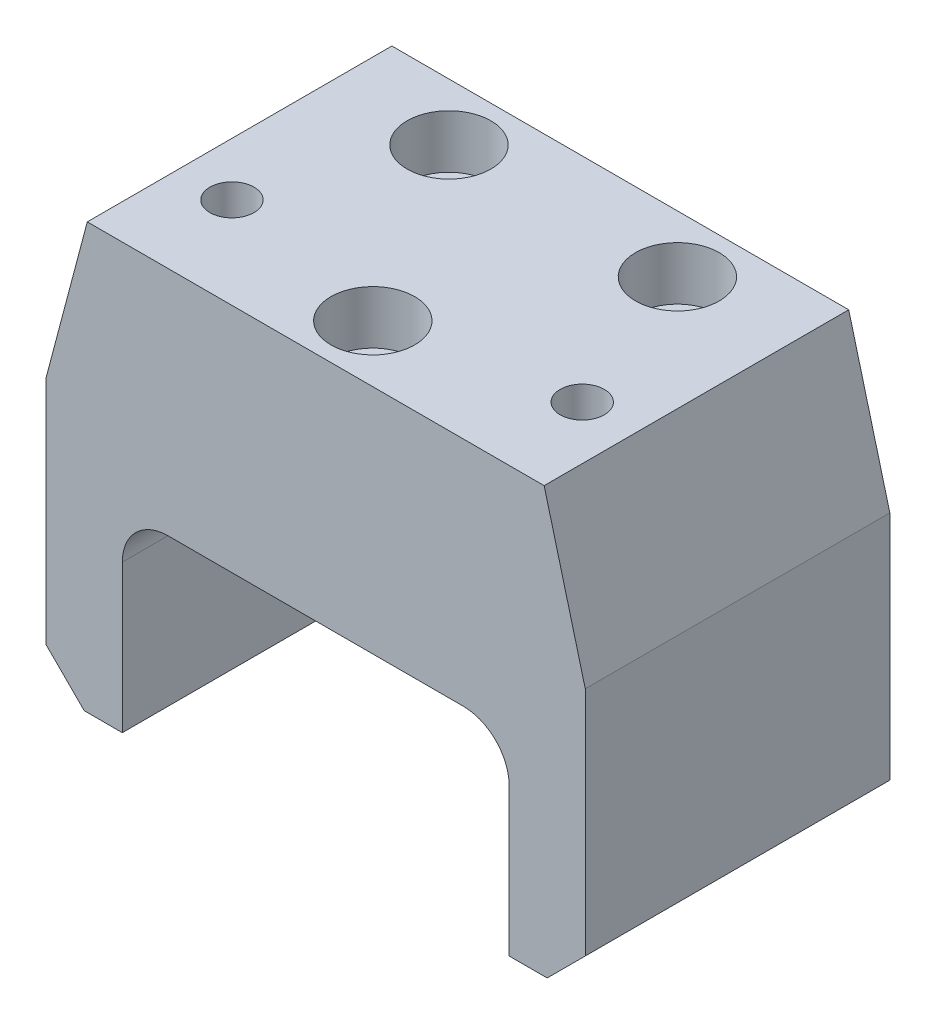
ISO-10303-21;
HEADER;
FILE_DESCRIPTION(('STEP AP214'),'2;1');
FILE_NAME('part.step','',(''),(''),'','','');
FILE_SCHEMA(('AUTOMOTIVE_DESIGN { 1 0 10303 214 1 1 1 1 }'));
ENDSEC;
DATA;
#1=APPLICATION_CONTEXT('core data for automotive mechanical design processes');
#2=APPLICATION_PROTOCOL_DEFINITION('international standard','automotive_design',2000,#1);
#3=PRODUCT_CONTEXT('',#1,'mechanical');
#4=PRODUCT('Part','Part','',(#3));
#5=PRODUCT_RELATED_PRODUCT_CATEGORY('part','',(#4));
#6=PRODUCT_DEFINITION_FORMATION('','',#4);
#7=PRODUCT_DEFINITION_CONTEXT('part definition',#1,'design');
#8=PRODUCT_DEFINITION('design','',#6,#7);
#9=PRODUCT_DEFINITION_SHAPE('','',#8);
#10=(LENGTH_UNIT() NAMED_UNIT(*) SI_UNIT(.MILLI.,.METRE.));
#11=(NAMED_UNIT(*) PLANE_ANGLE_UNIT() SI_UNIT($,.RADIAN.));
#12=(NAMED_UNIT(*) SI_UNIT($,.STERADIAN.) SOLID_ANGLE_UNIT());
#13=UNCERTAINTY_MEASURE_WITH_UNIT(LENGTH_MEASURE(1.E-05),#10,'distance_accuracy_value','');
#14=(GEOMETRIC_REPRESENTATION_CONTEXT(3) GLOBAL_UNCERTAINTY_ASSIGNED_CONTEXT((#13)) GLOBAL_UNIT_ASSIGNED_CONTEXT((#10,
#11,#12)) REPRESENTATION_CONTEXT('',''));
#15=CARTESIAN_POINT('',(0.,0.,0.));
#16=DIRECTION('',(0.,0.,1.));
#17=DIRECTION('',(1.,0.,0.));
#18=AXIS2_PLACEMENT_3D('',#15,#16,#17);
#19=CARTESIAN_POINT('',(0.,-31.,12.5));
#20=DIRECTION('',(0.,1.,0.));
#21=DIRECTION('',(-1.,0.,0.));
#22=AXIS2_PLACEMENT_3D('',#19,#20,#21);
#23=CYLINDRICAL_SURFACE('',#22,3.05);
#24=CARTESIAN_POINT('',(0.,-24.4,12.5));
#25=DIRECTION('',(0.,1.,0.));
#26=DIRECTION('',(-1.,0.,0.));
#27=AXIS2_PLACEMENT_3D('',#24,#25,#26);
#28=CIRCLE('',#27,3.05);
#29=CARTESIAN_POINT('',(-3.04999999999999,-24.4,12.5));
#30=VERTEX_POINT('',#29);
#31=EDGE_CURVE('E358',#30,#30,#28,.T.);
#32=ORIENTED_EDGE('',*,*,#31,.F.);
#33=EDGE_LOOP('',(#32));
#34=FACE_BOUND('',#33,.T.);
#35=CARTESIAN_POINT('',(0.,-1.,12.5));
#36=DIRECTION('',(0.,1.,0.));
#37=DIRECTION('',(-1.,0.,0.));
#38=AXIS2_PLACEMENT_3D('',#35,#36,#37);
#39=CIRCLE('',#38,3.05);
#40=CARTESIAN_POINT('',(-3.04999999999999,-1.,12.5));
#41=VERTEX_POINT('',#40);
#42=EDGE_CURVE('E205',#41,#41,#39,.F.);
#43=ORIENTED_EDGE('',*,*,#42,.F.);
#44=EDGE_LOOP('',(#43));
#45=FACE_BOUND('',#44,.T.);
#46=ADVANCED_FACE('F34',(#34,#45),#23,.F.);
#47=CARTESIAN_POINT('',(15.,-31.,-12.5));
#48=DIRECTION('',(0.,1.,0.));
#49=DIRECTION('',(-1.,0.,0.));
#50=AXIS2_PLACEMENT_3D('',#47,#48,#49);
#51=CYLINDRICAL_SURFACE('',#50,3.05);
#52=CARTESIAN_POINT('',(15.,-24.4,-12.5));
#53=DIRECTION('',(0.,1.,0.));
#54=DIRECTION('',(-1.,0.,0.));
#55=AXIS2_PLACEMENT_3D('',#52,#53,#54);
#56=CIRCLE('',#55,3.05);
#57=CARTESIAN_POINT('',(11.95,-24.4,-12.5));
#58=VERTEX_POINT('',#57);
#59=EDGE_CURVE('E200',#58,#58,#56,.T.);
#60=ORIENTED_EDGE('',*,*,#59,.F.);
#61=EDGE_LOOP('',(#60));
#62=FACE_BOUND('',#61,.T.);
#63=CARTESIAN_POINT('',(15.,-1.,-12.5));
#64=DIRECTION('',(0.,1.,0.));
#65=DIRECTION('',(-1.,0.,0.));
#66=AXIS2_PLACEMENT_3D('',#63,#64,#65);
#67=CIRCLE('',#66,3.05);
#68=CARTESIAN_POINT('',(11.95,-1.,-12.5));
#69=VERTEX_POINT('',#68);
#70=EDGE_CURVE('E202',#69,#69,#67,.F.);
#71=ORIENTED_EDGE('',*,*,#70,.F.);
#72=EDGE_LOOP('',(#71));
#73=FACE_BOUND('',#72,.T.);
#74=ADVANCED_FACE('F245',(#62,#73),#51,.F.);
#75=CARTESIAN_POINT('',(-15.,-31.,-12.5));
#76=DIRECTION('',(0.,1.,0.));
#77=DIRECTION('',(-1.,0.,0.));
#78=AXIS2_PLACEMENT_3D('',#75,#76,#77);
#79=CYLINDRICAL_SURFACE('',#78,3.05);
#80=CARTESIAN_POINT('',(-15.,-24.4,-12.5));
#81=DIRECTION('',(0.,1.,0.));
#82=DIRECTION('',(-1.,0.,0.));
#83=AXIS2_PLACEMENT_3D('',#80,#81,#82);
#84=CIRCLE('',#83,3.05);
#85=CARTESIAN_POINT('',(-18.05,-24.4,-12.5));
#86=VERTEX_POINT('',#85);
#87=EDGE_CURVE('E362',#86,#86,#84,.T.);
#88=ORIENTED_EDGE('',*,*,#87,.F.);
#89=EDGE_LOOP('',(#88));
#90=FACE_BOUND('',#89,.T.);
#91=CARTESIAN_POINT('',(-15.,-1.,-12.5));
#92=DIRECTION('',(0.,1.,0.));
#93=DIRECTION('',(-1.,0.,0.));
#94=AXIS2_PLACEMENT_3D('',#91,#92,#93);
#95=CIRCLE('',#94,3.05);
#96=CARTESIAN_POINT('',(-18.05,-1.,-12.5));
#97=VERTEX_POINT('',#96);
#98=EDGE_CURVE('E197',#97,#97,#95,.F.);
#99=ORIENTED_EDGE('',*,*,#98,.F.);
#100=EDGE_LOOP('',(#99));
#101=FACE_BOUND('',#100,.T.);
#102=ADVANCED_FACE('F251',(#90,#101),#79,.F.);
#103=CARTESIAN_POINT('',(-35.4,5.99999999999999,20.));
#104=DIRECTION('',(1.,0.,0.));
#105=DIRECTION('',(0.,1.,0.));
#106=AXIS2_PLACEMENT_3D('',#103,#104,#105);
#107=PLANE('',#106);
#108=DIRECTION('',(0.,-1.,0.));
#109=VECTOR('',#108,1.);
#110=CARTESIAN_POINT('',(-35.4,5.99999999999999,-20.));
#111=LINE('',#110,#109);
#112=CARTESIAN_POINT('',(-35.4,-14.4,-20.));
#113=VERTEX_POINT('',#112);
#114=CARTESIAN_POINT('',(-35.4,-44.8,-20.));
#115=VERTEX_POINT('',#114);
#116=EDGE_CURVE('E333',#113,#115,#111,.T.);
#117=ORIENTED_EDGE('',*,*,#116,.T.);
#118=DIRECTION('',(0.,0.,1.));
#119=VECTOR('',#118,1.);
#120=CARTESIAN_POINT('',(-35.4,-44.8,20.));
#121=LINE('',#120,#119);
#122=CARTESIAN_POINT('',(-35.4,-44.8,20.));
#123=VERTEX_POINT('',#122);
#124=EDGE_CURVE('E216',#115,#123,#121,.T.);
#125=ORIENTED_EDGE('',*,*,#124,.T.);
#126=DIRECTION('',(0.,-1.,0.));
#127=VECTOR('',#126,1.);
#128=CARTESIAN_POINT('',(-35.4,5.99999999999999,20.));
#129=LINE('',#128,#127);
#130=CARTESIAN_POINT('',(-35.4,-14.4,20.));
#131=VERTEX_POINT('',#130);
#132=EDGE_CURVE('E163',#131,#123,#129,.T.);
#133=ORIENTED_EDGE('',*,*,#132,.F.);
#134=DIRECTION('',(0.,0.,1.));
#135=VECTOR('',#134,1.);
#136=CARTESIAN_POINT('',(-35.4,-14.4,-20.));
#137=LINE('',#136,#135);
#138=EDGE_CURVE('E350',#113,#131,#137,.T.);
#139=ORIENTED_EDGE('',*,*,#138,.F.);
#140=EDGE_LOOP('',(#117,#125,#133,#139));
#141=FACE_BOUND('',#140,.T.);
#142=ADVANCED_FACE('F295',(#141),#107,.F.);
#143=CARTESIAN_POINT('',(-35.4,-49.8,20.));
#144=DIRECTION('',(0.,1.,0.));
#145=DIRECTION('',(0.,0.,1.));
#146=AXIS2_PLACEMENT_3D('',#143,#144,#145);
#147=PLANE('',#146);
#148=DIRECTION('',(1.,0.,0.));
#149=VECTOR('',#148,1.);
#150=CARTESIAN_POINT('',(-35.4,-49.8,20.));
#151=LINE('',#150,#149);
#152=CARTESIAN_POINT('',(-30.4,-49.8,20.));
#153=VERTEX_POINT('',#152);
#154=CARTESIAN_POINT('',(-25.4,-49.8,20.));
#155=VERTEX_POINT('',#154);
#156=EDGE_CURVE('E167',#153,#155,#151,.T.);
#157=ORIENTED_EDGE('',*,*,#156,.F.);
#158=DIRECTION('',(0.,0.,-1.));
#159=VECTOR('',#158,1.);
#160=CARTESIAN_POINT('',(-30.4,-49.8,20.));
#161=LINE('',#160,#159);
#162=CARTESIAN_POINT('',(-30.4,-49.8,-20.));
#163=VERTEX_POINT('',#162);
#164=EDGE_CURVE('E196',#153,#163,#161,.T.);
#165=ORIENTED_EDGE('',*,*,#164,.T.);
#166=DIRECTION('',(1.,0.,0.));
#167=VECTOR('',#166,1.);
#168=CARTESIAN_POINT('',(-35.4,-49.8,-20.));
#169=LINE('',#168,#167);
#170=CARTESIAN_POINT('',(-25.4,-49.8,-20.));
#171=VERTEX_POINT('',#170);
#172=EDGE_CURVE('E331',#163,#171,#169,.T.);
#173=ORIENTED_EDGE('',*,*,#172,.T.);
#174=DIRECTION('',(0.,0.,-1.));
#175=VECTOR('',#174,1.);
#176=CARTESIAN_POINT('',(-25.4,-49.8,20.));
#177=LINE('',#176,#175);
#178=EDGE_CURVE('E176',#155,#171,#177,.T.);
#179=ORIENTED_EDGE('',*,*,#178,.F.);
#180=EDGE_LOOP('',(#157,#165,#173,#179));
#181=FACE_BOUND('',#180,.T.);
#182=ADVANCED_FACE('F291',(#181),#147,.F.);
#183=CARTESIAN_POINT('',(-25.4,-49.8,20.));
#184=DIRECTION('',(-1.,0.,0.));
#185=DIRECTION('',(0.,0.,1.));
#186=AXIS2_PLACEMENT_3D('',#183,#184,#185);
#187=PLANE('',#186);
#188=DIRECTION('',(0.,0.,-1.));
#189=VECTOR('',#188,1.);
#190=CARTESIAN_POINT('',(-25.4,-30.4,20.));
#191=LINE('',#190,#189);
#192=CARTESIAN_POINT('',(-25.4,-30.4,-20.));
#193=VERTEX_POINT('',#192);
#194=CARTESIAN_POINT('',(-25.4,-30.4,20.));
#195=VERTEX_POINT('',#194);
#196=EDGE_CURVE('E186',#193,#195,#191,.F.);
#197=ORIENTED_EDGE('',*,*,#196,.T.);
#198=DIRECTION('',(0.,1.,0.));
#199=VECTOR('',#198,1.);
#200=CARTESIAN_POINT('',(-25.4,-49.8,20.));
#201=LINE('',#200,#199);
#202=EDGE_CURVE('E346',#155,#195,#201,.T.);
#203=ORIENTED_EDGE('',*,*,#202,.F.);
#204=ORIENTED_EDGE('',*,*,#178,.T.);
#205=DIRECTION('',(0.,1.,0.));
#206=VECTOR('',#205,1.);
#207=CARTESIAN_POINT('',(-25.4,-49.8,-20.));
#208=LINE('',#207,#206);
#209=EDGE_CURVE('E328',#171,#193,#208,.T.);
#210=ORIENTED_EDGE('',*,*,#209,.T.);
#211=EDGE_LOOP('',(#197,#203,#204,#210));
#212=FACE_BOUND('',#211,.T.);
#213=ADVANCED_FACE('F287',(#212),#187,.F.);
#214=CARTESIAN_POINT('',(-25.4,-24.4,20.));
#215=DIRECTION('',(0.,1.,0.));
#216=DIRECTION('',(-1.,0.,0.));
#217=AXIS2_PLACEMENT_3D('',#214,#215,#216);
#218=PLANE('',#217);
#219=ORIENTED_EDGE('',*,*,#87,.T.);
#220=EDGE_LOOP('',(#219));
#221=FACE_BOUND('',#220,.T.);
#222=ORIENTED_EDGE('',*,*,#59,.T.);
#223=EDGE_LOOP('',(#222));
#224=FACE_BOUND('',#223,.T.);
#225=ORIENTED_EDGE('',*,*,#31,.T.);
#226=EDGE_LOOP('',(#225));
#227=FACE_BOUND('',#226,.T.);
#228=DIRECTION('',(1.,0.,0.));
#229=VECTOR('',#228,1.);
#230=CARTESIAN_POINT('',(-25.4,-24.4,-20.));
#231=LINE('',#230,#229);
#232=CARTESIAN_POINT('',(-19.4,-24.4,-20.));
#233=VERTEX_POINT('',#232);
#234=CARTESIAN_POINT('',(19.4,-24.4,-20.));
#235=VERTEX_POINT('',#234);
#236=EDGE_CURVE('E323',#233,#235,#231,.T.);
#237=ORIENTED_EDGE('',*,*,#236,.T.);
#238=DIRECTION('',(0.,0.,-1.));
#239=VECTOR('',#238,1.);
#240=CARTESIAN_POINT('',(19.4,-24.4,20.));
#241=LINE('',#240,#239);
#242=CARTESIAN_POINT('',(19.4,-24.4,20.));
#243=VERTEX_POINT('',#242);
#244=EDGE_CURVE('E184',#235,#243,#241,.F.);
#245=ORIENTED_EDGE('',*,*,#244,.T.);
#246=DIRECTION('',(1.,0.,0.));
#247=VECTOR('',#246,1.);
#248=CARTESIAN_POINT('',(-25.4,-24.4,20.));
#249=LINE('',#248,#247);
#250=CARTESIAN_POINT('',(-19.4,-24.4,20.));
#251=VERTEX_POINT('',#250);
#252=EDGE_CURVE('E343',#251,#243,#249,.T.);
#253=ORIENTED_EDGE('',*,*,#252,.F.);
#254=DIRECTION('',(0.,0.,-1.));
#255=VECTOR('',#254,1.);
#256=CARTESIAN_POINT('',(-19.4,-24.4,-20.));
#257=LINE('',#256,#255);
#258=EDGE_CURVE('E181',#251,#233,#257,.T.);
#259=ORIENTED_EDGE('',*,*,#258,.T.);
#260=EDGE_LOOP('',(#237,#245,#253,#259));
#261=FACE_BOUND('',#260,.T.);
#262=ADVANCED_FACE('F283',(#221,#224,#227,#261),#218,.F.);
#263=CARTESIAN_POINT('',(25.4,-49.8,20.));
#264=DIRECTION('',(1.,0.,0.));
#265=DIRECTION('',(0.,0.,-1.));
#266=AXIS2_PLACEMENT_3D('',#263,#264,#265);
#267=PLANE('',#266);
#268=DIRECTION('',(0.,0.,-1.));
#269=VECTOR('',#268,1.);
#270=CARTESIAN_POINT('',(25.4,-30.4,-20.));
#271=LINE('',#270,#269);
#272=CARTESIAN_POINT('',(25.4,-30.4,20.));
#273=VERTEX_POINT('',#272);
#274=CARTESIAN_POINT('',(25.4,-30.4,-20.));
#275=VERTEX_POINT('',#274);
#276=EDGE_CURVE('E179',#273,#275,#271,.T.);
#277=ORIENTED_EDGE('',*,*,#276,.T.);
#278=DIRECTION('',(0.,-1.,0.));
#279=VECTOR('',#278,1.);
#280=CARTESIAN_POINT('',(25.4,-49.8,-20.));
#281=LINE('',#280,#279);
#282=CARTESIAN_POINT('',(25.4,-49.8,-20.));
#283=VERTEX_POINT('',#282);
#284=EDGE_CURVE('E322',#275,#283,#281,.T.);
#285=ORIENTED_EDGE('',*,*,#284,.T.);
#286=DIRECTION('',(0.,0.,-1.));
#287=VECTOR('',#286,1.);
#288=CARTESIAN_POINT('',(25.4,-49.8,20.));
#289=LINE('',#288,#287);
#290=CARTESIAN_POINT('',(25.4,-49.8,20.));
#291=VERTEX_POINT('',#290);
#292=EDGE_CURVE('E173',#291,#283,#289,.T.);
#293=ORIENTED_EDGE('',*,*,#292,.F.);
#294=DIRECTION('',(0.,-1.,0.));
#295=VECTOR('',#294,1.);
#296=CARTESIAN_POINT('',(25.4,-49.8,20.));
#297=LINE('',#296,#295);
#298=EDGE_CURVE('E341',#273,#291,#297,.T.);
#299=ORIENTED_EDGE('',*,*,#298,.F.);
#300=EDGE_LOOP('',(#277,#285,#293,#299));
#301=FACE_BOUND('',#300,.T.);
#302=ADVANCED_FACE('F280',(#301),#267,.F.);
#303=CARTESIAN_POINT('',(35.4,-49.8,20.));
#304=DIRECTION('',(0.,1.,0.));
#305=DIRECTION('',(0.,0.,1.));
#306=AXIS2_PLACEMENT_3D('',#303,#304,#305);
#307=PLANE('',#306);
#308=DIRECTION('',(1.,0.,0.));
#309=VECTOR('',#308,1.);
#310=CARTESIAN_POINT('',(35.4,-49.8,-20.));
#311=LINE('',#310,#309);
#312=CARTESIAN_POINT('',(30.4,-49.8,-20.));
#313=VERTEX_POINT('',#312);
#314=EDGE_CURVE('E169',#283,#313,#311,.T.);
#315=ORIENTED_EDGE('',*,*,#314,.T.);
#316=DIRECTION('',(0.,0.,1.));
#317=VECTOR('',#316,1.);
#318=CARTESIAN_POINT('',(30.4,-49.8,20.));
#319=LINE('',#318,#317);
#320=CARTESIAN_POINT('',(30.4,-49.8,20.));
#321=VERTEX_POINT('',#320);
#322=EDGE_CURVE('E57',#313,#321,#319,.T.);
#323=ORIENTED_EDGE('',*,*,#322,.T.);
#324=DIRECTION('',(1.,0.,0.));
#325=VECTOR('',#324,1.);
#326=CARTESIAN_POINT('',(35.4,-49.8,20.));
#327=LINE('',#326,#325);
#328=EDGE_CURVE('E339',#291,#321,#327,.T.);
#329=ORIENTED_EDGE('',*,*,#328,.F.);
#330=ORIENTED_EDGE('',*,*,#292,.T.);
#331=EDGE_LOOP('',(#315,#323,#329,#330));
#332=FACE_BOUND('',#331,.T.);
#333=ADVANCED_FACE('F276',(#332),#307,.F.);
#334=CARTESIAN_POINT('',(35.4,6.,20.));
#335=DIRECTION('',(-1.,0.,0.));
#336=DIRECTION('',(0.,-1.,0.));
#337=AXIS2_PLACEMENT_3D('',#334,#335,#336);
#338=PLANE('',#337);
#339=DIRECTION('',(0.,1.,0.));
#340=VECTOR('',#339,1.);
#341=CARTESIAN_POINT('',(35.4,6.,20.));
#342=LINE('',#341,#340);
#343=CARTESIAN_POINT('',(35.4,-44.8,20.));
#344=VERTEX_POINT('',#343);
#345=CARTESIAN_POINT('',(35.4,-14.4,20.));
#346=VERTEX_POINT('',#345);
#347=EDGE_CURVE('E318',#344,#346,#342,.T.);
#348=ORIENTED_EDGE('',*,*,#347,.F.);
#349=DIRECTION('',(0.,0.,-1.));
#350=VECTOR('',#349,1.);
#351=CARTESIAN_POINT('',(35.4,-44.8,20.));
#352=LINE('',#351,#350);
#353=CARTESIAN_POINT('',(35.4,-44.8,-20.));
#354=VERTEX_POINT('',#353);
#355=EDGE_CURVE('E221',#344,#354,#352,.T.);
#356=ORIENTED_EDGE('',*,*,#355,.T.);
#357=DIRECTION('',(0.,1.,0.));
#358=VECTOR('',#357,1.);
#359=CARTESIAN_POINT('',(35.4,6.,-20.));
#360=LINE('',#359,#358);
#361=CARTESIAN_POINT('',(35.4,-14.4,-20.));
#362=VERTEX_POINT('',#361);
#363=EDGE_CURVE('E164',#354,#362,#360,.T.);
#364=ORIENTED_EDGE('',*,*,#363,.T.);
#365=DIRECTION('',(0.,0.,1.));
#366=VECTOR('',#365,1.);
#367=CARTESIAN_POINT('',(35.4,-14.4,-20.));
#368=LINE('',#367,#366);
#369=EDGE_CURVE('E144',#362,#346,#368,.T.);
#370=ORIENTED_EDGE('',*,*,#369,.T.);
#371=EDGE_LOOP('',(#348,#356,#364,#370));
#372=FACE_BOUND('',#371,.T.);
#373=ADVANCED_FACE('F272',(#372),#338,.F.);
#374=CARTESIAN_POINT('',(35.4,6.,20.));
#375=DIRECTION('',(0.,-1.,0.));
#376=DIRECTION('',(1.,0.,0.));
#377=AXIS2_PLACEMENT_3D('',#374,#375,#376);
#378=PLANE('',#377);
#379=CARTESIAN_POINT('',(23.,6.,8.));
#380=DIRECTION('',(0.,1.,0.));
#381=DIRECTION('',(1.,0.,0.));
#382=AXIS2_PLACEMENT_3D('',#379,#380,#381);
#383=CIRCLE('',#382,2.9);
#384=CARTESIAN_POINT('',(20.1,5.99999999999999,8.));
#385=VERTEX_POINT('',#384);
#386=EDGE_CURVE('E385',#385,#385,#383,.T.);
#387=ORIENTED_EDGE('',*,*,#386,.F.);
#388=EDGE_LOOP('',(#387));
#389=FACE_BOUND('',#388,.T.);
#390=CARTESIAN_POINT('',(-23.,5.99999999999999,8.));
#391=DIRECTION('',(0.,1.,0.));
#392=DIRECTION('',(-1.,0.,0.));
#393=AXIS2_PLACEMENT_3D('',#390,#391,#392);
#394=CIRCLE('',#393,2.9);
#395=CARTESIAN_POINT('',(-25.9,5.99999999999999,8.));
#396=VERTEX_POINT('',#395);
#397=EDGE_CURVE('E375',#396,#396,#394,.T.);
#398=ORIENTED_EDGE('',*,*,#397,.F.);
#399=EDGE_LOOP('',(#398));
#400=FACE_BOUND('',#399,.T.);
#401=CARTESIAN_POINT('',(15.,6.,-12.5));
#402=DIRECTION('',(0.,1.,0.));
#403=DIRECTION('',(-1.,0.,0.));
#404=AXIS2_PLACEMENT_3D('',#401,#402,#403);
#405=CIRCLE('',#404,5.5);
#406=CARTESIAN_POINT('',(9.5,6.,-12.5));
#407=VERTEX_POINT('',#406);
#408=EDGE_CURVE('E378',#407,#407,#405,.T.);
#409=ORIENTED_EDGE('',*,*,#408,.F.);
#410=EDGE_LOOP('',(#409));
#411=FACE_BOUND('',#410,.T.);
#412=CARTESIAN_POINT('',(0.,6.,12.5));
#413=DIRECTION('',(0.,1.,0.));
#414=DIRECTION('',(-1.,0.,0.));
#415=AXIS2_PLACEMENT_3D('',#412,#413,#414);
#416=CIRCLE('',#415,5.5);
#417=CARTESIAN_POINT('',(-5.49999999999999,5.99999999999999,12.5));
#418=VERTEX_POINT('',#417);
#419=EDGE_CURVE('E371',#418,#418,#416,.T.);
#420=ORIENTED_EDGE('',*,*,#419,.F.);
#421=EDGE_LOOP('',(#420));
#422=FACE_BOUND('',#421,.T.);
#423=CARTESIAN_POINT('',(-15.,5.99999999999999,-12.5));
#424=DIRECTION('',(0.,1.,0.));
#425=DIRECTION('',(-1.,0.,0.));
#426=AXIS2_PLACEMENT_3D('',#423,#424,#425);
#427=CIRCLE('',#426,5.5);
#428=CARTESIAN_POINT('',(-20.5,5.99999999999999,-12.5));
#429=VERTEX_POINT('',#428);
#430=EDGE_CURVE('E209',#429,#429,#427,.T.);
#431=ORIENTED_EDGE('',*,*,#430,.F.);
#432=EDGE_LOOP('',(#431));
#433=FACE_BOUND('',#432,.T.);
#434=DIRECTION('',(-1.,0.,0.));
#435=VECTOR('',#434,1.);
#436=CARTESIAN_POINT('',(35.4,6.,20.));
#437=LINE('',#436,#435);
#438=CARTESIAN_POINT('',(30.,6.00000000000001,20.));
#439=VERTEX_POINT('',#438);
#440=CARTESIAN_POINT('',(-30.,6.00000000000001,20.));
#441=VERTEX_POINT('',#440);
#442=EDGE_CURVE('E156',#439,#441,#437,.T.);
#443=ORIENTED_EDGE('',*,*,#442,.F.);
#444=DIRECTION('',(0.,0.,1.));
#445=VECTOR('',#444,1.);
#446=CARTESIAN_POINT('',(30.,6.00000000000001,-20.));
#447=LINE('',#446,#445);
#448=CARTESIAN_POINT('',(30.,6.00000000000001,-20.));
#449=VERTEX_POINT('',#448);
#450=EDGE_CURVE('E141',#449,#439,#447,.T.);
#451=ORIENTED_EDGE('',*,*,#450,.F.);
#452=DIRECTION('',(-1.,0.,0.));
#453=VECTOR('',#452,1.);
#454=CARTESIAN_POINT('',(35.4,6.,-20.));
#455=LINE('',#454,#453);
#456=CARTESIAN_POINT('',(-30.,5.99999999999999,-20.));
#457=VERTEX_POINT('',#456);
#458=EDGE_CURVE('E154',#449,#457,#455,.T.);
#459=ORIENTED_EDGE('',*,*,#458,.T.);
#460=DIRECTION('',(0.,0.,1.));
#461=VECTOR('',#460,1.);
#462=CARTESIAN_POINT('',(-30.,6.00000000000001,-20.));
#463=LINE('',#462,#461);
#464=EDGE_CURVE('E336',#457,#441,#463,.T.);
#465=ORIENTED_EDGE('',*,*,#464,.T.);
#466=EDGE_LOOP('',(#443,#451,#459,#465));
#467=FACE_BOUND('',#466,.T.);
#468=ADVANCED_FACE('F152',(#389,#400,#411,#422,#433,#467),#378,.F.);
#469=CARTESIAN_POINT('',(0.,0.,20.));
#470=DIRECTION('',(0.,0.,1.));
#471=DIRECTION('',(1.,0.,0.));
#472=AXIS2_PLACEMENT_3D('',#469,#470,#471);
#473=PLANE('',#472);
#474=ORIENTED_EDGE('',*,*,#132,.T.);
#475=DIRECTION('',(-0.707106781186548,0.707106781186548,0.));
#476=VECTOR('',#475,1.);
#477=CARTESIAN_POINT('',(-40.1,-40.1,20.));
#478=LINE('',#477,#476);
#479=EDGE_CURVE('E219',#123,#153,#478,.F.);
#480=ORIENTED_EDGE('',*,*,#479,.T.);
#481=ORIENTED_EDGE('',*,*,#156,.T.);
#482=ORIENTED_EDGE('',*,*,#202,.T.);
#483=CARTESIAN_POINT('',(-19.4,-30.4,20.));
#484=DIRECTION('',(0.,0.,1.));
#485=DIRECTION('',(1.,0.,0.));
#486=AXIS2_PLACEMENT_3D('',#483,#484,#485);
#487=CIRCLE('',#486,6.);
#488=EDGE_CURVE('E194',#195,#251,#487,.F.);
#489=ORIENTED_EDGE('',*,*,#488,.T.);
#490=ORIENTED_EDGE('',*,*,#252,.T.);
#491=CARTESIAN_POINT('',(19.4,-30.4,20.));
#492=DIRECTION('',(0.,0.,1.));
#493=DIRECTION('',(1.,0.,0.));
#494=AXIS2_PLACEMENT_3D('',#491,#492,#493);
#495=CIRCLE('',#494,6.);
#496=EDGE_CURVE('E190',#243,#273,#495,.F.);
#497=ORIENTED_EDGE('',*,*,#496,.T.);
#498=ORIENTED_EDGE('',*,*,#298,.T.);
#499=ORIENTED_EDGE('',*,*,#328,.T.);
#500=DIRECTION('',(-0.70710678118655,-0.707106781186546,0.));
#501=VECTOR('',#500,1.);
#502=CARTESIAN_POINT('',(40.0999999999999,-40.1000000000001,20.));
#503=LINE('',#502,#501);
#504=EDGE_CURVE('E49',#321,#344,#503,.F.);
#505=ORIENTED_EDGE('',*,*,#504,.T.);
#506=ORIENTED_EDGE('',*,*,#347,.T.);
#507=DIRECTION('',(0.255892560316283,-0.966705227861512,0.));
#508=VECTOR('',#507,1.);
#509=CARTESIAN_POINT('',(30.,6.00000000000001,20.));
#510=LINE('',#509,#508);
#511=EDGE_CURVE('E148',#439,#346,#510,.T.);
#512=ORIENTED_EDGE('',*,*,#511,.F.);
#513=ORIENTED_EDGE('',*,*,#442,.T.);
#514=DIRECTION('',(0.255892560316283,0.966705227861512,0.));
#515=VECTOR('',#514,1.);
#516=CARTESIAN_POINT('',(-30.,6.00000000000001,20.));
#517=LINE('',#516,#515);
#518=EDGE_CURVE('E353',#131,#441,#517,.T.);
#519=ORIENTED_EDGE('',*,*,#518,.F.);
#520=EDGE_LOOP('',(#474,#480,#481,#482,#489,#490,#497,#498,#499,#505,#506,#512,#513,#519));
#521=FACE_BOUND('',#520,.T.);
#522=ADVANCED_FACE('F265',(#521),#473,.T.);
#523=CARTESIAN_POINT('',(0.,0.,-20.));
#524=DIRECTION('',(0.,0.,1.));
#525=DIRECTION('',(1.,0.,0.));
#526=AXIS2_PLACEMENT_3D('',#523,#524,#525);
#527=PLANE('',#526);
#528=ORIENTED_EDGE('',*,*,#172,.F.);
#529=DIRECTION('',(0.707106781186548,-0.707106781186548,0.));
#530=VECTOR('',#529,1.);
#531=CARTESIAN_POINT('',(-30.4,-49.8,-20.));
#532=LINE('',#531,#530);
#533=EDGE_CURVE('E214',#163,#115,#532,.F.);
#534=ORIENTED_EDGE('',*,*,#533,.T.);
#535=ORIENTED_EDGE('',*,*,#116,.F.);
#536=DIRECTION('',(0.255892560316283,0.966705227861512,0.));
#537=VECTOR('',#536,1.);
#538=CARTESIAN_POINT('',(-30.,6.00000000000001,-20.));
#539=LINE('',#538,#537);
#540=EDGE_CURVE('E162',#113,#457,#539,.T.);
#541=ORIENTED_EDGE('',*,*,#540,.T.);
#542=ORIENTED_EDGE('',*,*,#458,.F.);
#543=DIRECTION('',(0.255892560316283,-0.966705227861512,0.));
#544=VECTOR('',#543,1.);
#545=CARTESIAN_POINT('',(30.,6.00000000000001,-20.));
#546=LINE('',#545,#544);
#547=EDGE_CURVE('E137',#449,#362,#546,.T.);
#548=ORIENTED_EDGE('',*,*,#547,.T.);
#549=ORIENTED_EDGE('',*,*,#363,.F.);
#550=DIRECTION('',(0.70710678118655,0.707106781186546,0.));
#551=VECTOR('',#550,1.);
#552=CARTESIAN_POINT('',(35.4,-44.8,-20.));
#553=LINE('',#552,#551);
#554=EDGE_CURVE('E212',#354,#313,#553,.F.);
#555=ORIENTED_EDGE('',*,*,#554,.T.);
#556=ORIENTED_EDGE('',*,*,#314,.F.);
#557=ORIENTED_EDGE('',*,*,#284,.F.);
#558=CARTESIAN_POINT('',(19.4,-30.4,-20.));
#559=DIRECTION('',(0.,0.,1.));
#560=DIRECTION('',(1.,0.,0.));
#561=AXIS2_PLACEMENT_3D('',#558,#559,#560);
#562=CIRCLE('',#561,6.);
#563=EDGE_CURVE('E188',#275,#235,#562,.T.);
#564=ORIENTED_EDGE('',*,*,#563,.T.);
#565=ORIENTED_EDGE('',*,*,#236,.F.);
#566=CARTESIAN_POINT('',(-19.4,-30.4,-20.));
#567=DIRECTION('',(0.,0.,1.));
#568=DIRECTION('',(1.,0.,0.));
#569=AXIS2_PLACEMENT_3D('',#566,#567,#568);
#570=CIRCLE('',#569,6.);
#571=EDGE_CURVE('E192',#233,#193,#570,.T.);
#572=ORIENTED_EDGE('',*,*,#571,.T.);
#573=ORIENTED_EDGE('',*,*,#209,.F.);
#574=EDGE_LOOP('',(#528,#534,#535,#541,#542,#548,#549,#555,#556,#557,#564,#565,#572,#573));
#575=FACE_BOUND('',#574,.T.);
#576=ADVANCED_FACE('F160',(#575),#527,.F.);
#577=CARTESIAN_POINT('',(-30.,6.00000000000001,-20.));
#578=DIRECTION('',(0.966705227861512,-0.255892560316283,0.));
#579=DIRECTION('',(0.255892560316283,0.966705227861512,0.));
#580=AXIS2_PLACEMENT_3D('',#577,#578,#579);
#581=PLANE('',#580);
#582=ORIENTED_EDGE('',*,*,#518,.T.);
#583=ORIENTED_EDGE('',*,*,#464,.F.);
#584=ORIENTED_EDGE('',*,*,#540,.F.);
#585=ORIENTED_EDGE('',*,*,#138,.T.);
#586=EDGE_LOOP('',(#582,#583,#584,#585));
#587=FACE_BOUND('',#586,.T.);
#588=ADVANCED_FACE('F261',(#587),#581,.F.);
#589=CARTESIAN_POINT('',(30.,6.00000000000001,-20.));
#590=DIRECTION('',(-0.966705227861512,-0.255892560316283,0.));
#591=DIRECTION('',(0.255892560316283,-0.966705227861512,0.));
#592=AXIS2_PLACEMENT_3D('',#589,#590,#591);
#593=PLANE('',#592);
#594=ORIENTED_EDGE('',*,*,#511,.T.);
#595=ORIENTED_EDGE('',*,*,#369,.F.);
#596=ORIENTED_EDGE('',*,*,#547,.F.);
#597=ORIENTED_EDGE('',*,*,#450,.T.);
#598=EDGE_LOOP('',(#594,#595,#596,#597));
#599=FACE_BOUND('',#598,.T.);
#600=ADVANCED_FACE('F140',(#599),#593,.F.);
#601=CARTESIAN_POINT('',(19.4,-30.4,20.));
#602=DIRECTION('',(0.,0.,1.));
#603=DIRECTION('',(1.,0.,0.));
#604=AXIS2_PLACEMENT_3D('',#601,#602,#603);
#605=CYLINDRICAL_SURFACE('',#604,6.);
#606=ORIENTED_EDGE('',*,*,#563,.F.);
#607=ORIENTED_EDGE('',*,*,#276,.F.);
#608=ORIENTED_EDGE('',*,*,#496,.F.);
#609=ORIENTED_EDGE('',*,*,#244,.F.);
#610=EDGE_LOOP('',(#606,#607,#608,#609));
#611=FACE_BOUND('',#610,.T.);
#612=ADVANCED_FACE('F260',(#611),#605,.F.);
#613=CARTESIAN_POINT('',(-19.4,-30.4,20.));
#614=DIRECTION('',(0.,0.,1.));
#615=DIRECTION('',(1.,0.,0.));
#616=AXIS2_PLACEMENT_3D('',#613,#614,#615);
#617=CYLINDRICAL_SURFACE('',#616,6.);
#618=ORIENTED_EDGE('',*,*,#488,.F.);
#619=ORIENTED_EDGE('',*,*,#196,.F.);
#620=ORIENTED_EDGE('',*,*,#571,.F.);
#621=ORIENTED_EDGE('',*,*,#258,.F.);
#622=EDGE_LOOP('',(#618,#619,#620,#621));
#623=FACE_BOUND('',#622,.T.);
#624=ADVANCED_FACE('F302',(#623),#617,.F.);
#625=CARTESIAN_POINT('',(-15.,-1.00000000000001,-12.5));
#626=DIRECTION('',(0.,1.,0.));
#627=DIRECTION('',(-1.,0.,0.));
#628=AXIS2_PLACEMENT_3D('',#625,#626,#627);
#629=PLANE('',#628);
#630=CARTESIAN_POINT('',(-15.,-1.00000000000001,-12.5));
#631=DIRECTION('',(0.,1.,0.));
#632=DIRECTION('',(-1.,0.,0.));
#633=AXIS2_PLACEMENT_3D('',#630,#631,#632);
#634=CIRCLE('',#633,5.5);
#635=CARTESIAN_POINT('',(-20.5,-1.00000000000001,-12.5));
#636=VERTEX_POINT('',#635);
#637=EDGE_CURVE('E201',#636,#636,#634,.T.);
#638=ORIENTED_EDGE('',*,*,#637,.T.);
#639=EDGE_LOOP('',(#638));
#640=FACE_BOUND('',#639,.T.);
#641=ORIENTED_EDGE('',*,*,#98,.T.);
#642=EDGE_LOOP('',(#641));
#643=FACE_BOUND('',#642,.T.);
#644=ADVANCED_FACE('F306',(#640,#643),#629,.T.);
#645=CARTESIAN_POINT('',(-15.,-1.00000000000001,-12.5));
#646=DIRECTION('',(0.,1.,0.));
#647=DIRECTION('',(-1.,0.,0.));
#648=AXIS2_PLACEMENT_3D('',#645,#646,#647);
#649=CYLINDRICAL_SURFACE('',#648,5.5);
#650=ORIENTED_EDGE('',*,*,#637,.F.);
#651=EDGE_LOOP('',(#650));
#652=FACE_BOUND('',#651,.T.);
#653=ORIENTED_EDGE('',*,*,#430,.T.);
#654=EDGE_LOOP('',(#653));
#655=FACE_BOUND('',#654,.T.);
#656=ADVANCED_FACE('F399',(#652,#655),#649,.F.);
#657=CARTESIAN_POINT('',(15.,-1.,-12.5));
#658=DIRECTION('',(0.,1.,0.));
#659=DIRECTION('',(-1.,0.,0.));
#660=AXIS2_PLACEMENT_3D('',#657,#658,#659);
#661=PLANE('',#660);
#662=CARTESIAN_POINT('',(15.,-1.,-12.5));
#663=DIRECTION('',(0.,1.,0.));
#664=DIRECTION('',(-1.,0.,0.));
#665=AXIS2_PLACEMENT_3D('',#662,#663,#664);
#666=CIRCLE('',#665,5.5);
#667=CARTESIAN_POINT('',(9.5,-1.,-12.5));
#668=VERTEX_POINT('',#667);
#669=EDGE_CURVE('E206',#668,#668,#666,.T.);
#670=ORIENTED_EDGE('',*,*,#669,.T.);
#671=EDGE_LOOP('',(#670));
#672=FACE_BOUND('',#671,.T.);
#673=ORIENTED_EDGE('',*,*,#70,.T.);
#674=EDGE_LOOP('',(#673));
#675=FACE_BOUND('',#674,.T.);
#676=ADVANCED_FACE('F401',(#672,#675),#661,.T.);
#677=CARTESIAN_POINT('',(15.,-1.,-12.5));
#678=DIRECTION('',(0.,1.,0.));
#679=DIRECTION('',(-1.,0.,0.));
#680=AXIS2_PLACEMENT_3D('',#677,#678,#679);
#681=CYLINDRICAL_SURFACE('',#680,5.5);
#682=ORIENTED_EDGE('',*,*,#669,.F.);
#683=EDGE_LOOP('',(#682));
#684=FACE_BOUND('',#683,.T.);
#685=ORIENTED_EDGE('',*,*,#408,.T.);
#686=EDGE_LOOP('',(#685));
#687=FACE_BOUND('',#686,.T.);
#688=ADVANCED_FACE('F408',(#684,#687),#681,.F.);
#689=CARTESIAN_POINT('',(0.,-1.,12.5));
#690=DIRECTION('',(0.,1.,0.));
#691=DIRECTION('',(-1.,0.,0.));
#692=AXIS2_PLACEMENT_3D('',#689,#690,#691);
#693=PLANE('',#692);
#694=CARTESIAN_POINT('',(0.,-1.,12.5));
#695=DIRECTION('',(0.,1.,0.));
#696=DIRECTION('',(-1.,0.,0.));
#697=AXIS2_PLACEMENT_3D('',#694,#695,#696);
#698=CIRCLE('',#697,5.5);
#699=CARTESIAN_POINT('',(-5.49999999999999,-1.00000000000001,12.5));
#700=VERTEX_POINT('',#699);
#701=EDGE_CURVE('E374',#700,#700,#698,.T.);
#702=ORIENTED_EDGE('',*,*,#701,.T.);
#703=EDGE_LOOP('',(#702));
#704=FACE_BOUND('',#703,.T.);
#705=ORIENTED_EDGE('',*,*,#42,.T.);
#706=EDGE_LOOP('',(#705));
#707=FACE_BOUND('',#706,.T.);
#708=ADVANCED_FACE('F534',(#704,#707),#693,.T.);
#709=CARTESIAN_POINT('',(0.,-1.,12.5));
#710=DIRECTION('',(0.,1.,0.));
#711=DIRECTION('',(-1.,0.,0.));
#712=AXIS2_PLACEMENT_3D('',#709,#710,#711);
#713=CYLINDRICAL_SURFACE('',#712,5.5);
#714=ORIENTED_EDGE('',*,*,#701,.F.);
#715=EDGE_LOOP('',(#714));
#716=FACE_BOUND('',#715,.T.);
#717=ORIENTED_EDGE('',*,*,#419,.T.);
#718=EDGE_LOOP('',(#717));
#719=FACE_BOUND('',#718,.T.);
#720=ADVANCED_FACE('F543',(#716,#719),#713,.F.);
#721=CARTESIAN_POINT('',(-23.,-23.,8.));
#722=DIRECTION('',(0.,1.,0.));
#723=DIRECTION('',(-1.,0.,0.));
#724=AXIS2_PLACEMENT_3D('',#721,#722,#723);
#725=CYLINDRICAL_SURFACE('',#724,2.9);
#726=CARTESIAN_POINT('',(-23.,-21.,8.));
#727=DIRECTION('',(0.,1.,0.));
#728=DIRECTION('',(-1.,0.,0.));
#729=AXIS2_PLACEMENT_3D('',#726,#727,#728);
#730=CIRCLE('',#729,2.9);
#731=CARTESIAN_POINT('',(-25.9,-21.,8.));
#732=VERTEX_POINT('',#731);
#733=EDGE_CURVE('E11',#732,#732,#730,.F.);
#734=CARTESIAN_POINT('',(-25.9,-21.,8.));
#735=CARTESIAN_POINT('',(-25.9,-20.71875,8.));
#736=CARTESIAN_POINT('',(-25.9,-20.4375,8.));
#737=CARTESIAN_POINT('',(-25.9,-19.875,8.));
#738=CARTESIAN_POINT('',(-25.9,-19.59375,8.));
#739=CARTESIAN_POINT('',(-25.9,-19.03125,8.));
#740=CARTESIAN_POINT('',(-25.9,-18.75,8.));
#741=CARTESIAN_POINT('',(-25.9,-18.1875,8.));
#742=CARTESIAN_POINT('',(-25.9,-17.90625,8.));
#743=CARTESIAN_POINT('',(-25.9,-17.34375,8.));
#744=CARTESIAN_POINT('',(-25.9,-17.0625,8.));
#745=CARTESIAN_POINT('',(-25.9,-16.5,8.));
#746=CARTESIAN_POINT('',(-25.9,-16.21875,8.));
#747=CARTESIAN_POINT('',(-25.9,-15.65625,8.));
#748=CARTESIAN_POINT('',(-25.9,-15.375,8.));
#749=CARTESIAN_POINT('',(-25.9,-14.8125,8.));
#750=CARTESIAN_POINT('',(-25.9,-14.53125,8.));
#751=CARTESIAN_POINT('',(-25.9,-13.96875,8.));
#752=CARTESIAN_POINT('',(-25.9,-13.6875,8.));
#753=CARTESIAN_POINT('',(-25.9,-13.125,8.));
#754=CARTESIAN_POINT('',(-25.9,-12.84375,8.));
#755=CARTESIAN_POINT('',(-25.9,-12.28125,8.));
#756=CARTESIAN_POINT('',(-25.9,-12.,8.));
#757=CARTESIAN_POINT('',(-25.9,-11.4375,8.));
#758=CARTESIAN_POINT('',(-25.9,-11.15625,8.));
#759=CARTESIAN_POINT('',(-25.9,-10.59375,8.));
#760=CARTESIAN_POINT('',(-25.9,-10.3125,8.));
#761=CARTESIAN_POINT('',(-25.9,-9.75000000000002,8.));
#762=CARTESIAN_POINT('',(-25.9,-9.46875000000002,8.));
#763=CARTESIAN_POINT('',(-25.9,-8.90625000000002,8.));
#764=CARTESIAN_POINT('',(-25.9,-8.62500000000002,8.));
#765=CARTESIAN_POINT('',(-25.9,-8.06250000000002,8.));
#766=CARTESIAN_POINT('',(-25.9,-7.78125000000002,8.));
#767=CARTESIAN_POINT('',(-25.9,-7.21875000000002,8.));
#768=CARTESIAN_POINT('',(-25.9,-6.93750000000002,8.));
#769=CARTESIAN_POINT('',(-25.9,-6.37500000000002,8.));
#770=CARTESIAN_POINT('',(-25.9,-6.09375000000002,8.));
#771=CARTESIAN_POINT('',(-25.9,-5.53125000000002,8.));
#772=CARTESIAN_POINT('',(-25.9,-5.25000000000002,8.));
#773=CARTESIAN_POINT('',(-25.9,-4.68750000000002,8.));
#774=CARTESIAN_POINT('',(-25.9,-4.40625000000002,8.));
#775=CARTESIAN_POINT('',(-25.9,-3.84375000000002,8.));
#776=CARTESIAN_POINT('',(-25.9,-3.56250000000002,8.));
#777=CARTESIAN_POINT('',(-25.9,-3.00000000000002,8.));
#778=CARTESIAN_POINT('',(-25.9,-2.71875000000001,8.));
#779=CARTESIAN_POINT('',(-25.9,-2.15625000000001,8.));
#780=CARTESIAN_POINT('',(-25.9,-1.87500000000001,8.));
#781=CARTESIAN_POINT('',(-25.9,-1.31250000000001,8.));
#782=CARTESIAN_POINT('',(-25.9,-1.03125000000001,8.));
#783=CARTESIAN_POINT('',(-25.9,-0.468750000000012,8.));
#784=CARTESIAN_POINT('',(-25.9,-0.187500000000013,8.));
#785=CARTESIAN_POINT('',(-25.9,0.374999999999988,8.));
#786=CARTESIAN_POINT('',(-25.9,0.656249999999989,8.));
#787=CARTESIAN_POINT('',(-25.9,1.21874999999999,8.));
#788=CARTESIAN_POINT('',(-25.9,1.49999999999999,8.));
#789=CARTESIAN_POINT('',(-25.9,2.06249999999999,8.));
#790=CARTESIAN_POINT('',(-25.9,2.34374999999999,8.));
#791=CARTESIAN_POINT('',(-25.9,2.90624999999999,8.));
#792=CARTESIAN_POINT('',(-25.9,3.18749999999999,8.));
#793=CARTESIAN_POINT('',(-25.9,3.74999999999999,8.));
#794=CARTESIAN_POINT('',(-25.9,4.03124999999999,8.));
#795=CARTESIAN_POINT('',(-25.9,4.59374999999999,8.));
#796=CARTESIAN_POINT('',(-25.9,4.87499999999999,8.));
#797=CARTESIAN_POINT('',(-25.9,5.43749999999999,8.));
#798=CARTESIAN_POINT('',(-25.9,5.71874999999999,8.));
#799=CARTESIAN_POINT('',(-25.9,5.99999999999999,8.));
#800=B_SPLINE_CURVE_WITH_KNOTS('',3,(#734,#735,#736,#737,#738,#739,#740,#741,#742,#743,#744,
#745,#746,#747,#748,#749,#750,#751,#752,#753,#754,#755,#756,#757,#758,#759,#760,#761,#762,#763,
#764,#765,#766,#767,#768,#769,#770,#771,#772,#773,#774,#775,#776,#777,#778,#779,#780,#781,#782,
#783,#784,#785,#786,#787,#788,#789,#790,#791,#792,#793,#794,#795,#796,#797,#798,#799),
.UNSPECIFIED.,.F.,.F.,(4,2,2,2,2,2,2,2,2,2,2,2,2,2,2,2,2,2,2,2,2,2,2,2,2,2,2,2,2,2,2,2,4),(0.,
0.843750000000001,1.6875,2.53125,3.375,4.21875,5.0625,5.90625000000001,6.75000000000001,
7.59375000000001,8.43750000000001,9.28125000000001,10.125,10.96875,11.8125,12.65625,13.5,
14.34375,15.1875,16.03125,16.875,17.71875,18.5625,19.40625,20.25,21.09375,21.9375,22.78125,
23.625,24.46875,25.3125,26.15625,27.),.UNSPECIFIED.);
#801=EDGE_CURVE('BSEAM552',#732,#396,#800,.T.);
#802=ORIENTED_EDGE('',*,*,#733,.T.);
#803=ORIENTED_EDGE('',*,*,#397,.T.);
#804=ORIENTED_EDGE('',*,*,#801,.T.);
#805=ORIENTED_EDGE('',*,*,#801,.F.);
#806=EDGE_LOOP('',(#802,#804,#803,#805));
#807=FACE_BOUND('',#806,.T.);
#808=ADVANCED_FACE('F552',(#807),#725,.F.);
#809=CARTESIAN_POINT('',(-23.,-23.,8.));
#810=DIRECTION('',(0.,1.,0.));
#811=DIRECTION('',(-1.,0.,0.));
#812=AXIS2_PLACEMENT_3D('',#809,#810,#811);
#813=PLANE('',#812);
#814=CARTESIAN_POINT('',(-23.,-23.,8.));
#815=DIRECTION('',(0.,1.,0.));
#816=DIRECTION('',(-1.,0.,0.));
#817=AXIS2_PLACEMENT_3D('',#814,#815,#816);
#818=CIRCLE('',#817,0.9);
#819=CARTESIAN_POINT('',(-23.9,-23.,8.));
#820=VERTEX_POINT('',#819);
#821=EDGE_CURVE('E42',#820,#820,#818,.T.);
#822=ORIENTED_EDGE('',*,*,#821,.T.);
#823=EDGE_LOOP('',(#822));
#824=FACE_BOUND('',#823,.T.);
#825=ADVANCED_FACE('F233',(#824),#813,.T.);
#826=CARTESIAN_POINT('',(23.,-23.,8.));
#827=DIRECTION('',(0.,1.,0.));
#828=DIRECTION('',(-1.,0.,0.));
#829=AXIS2_PLACEMENT_3D('',#826,#827,#828);
#830=CYLINDRICAL_SURFACE('',#829,2.9);
#831=CARTESIAN_POINT('',(23.,-21.,8.));
#832=DIRECTION('',(0.,-1.,0.));
#833=DIRECTION('',(1.,0.,0.));
#834=AXIS2_PLACEMENT_3D('',#831,#832,#833);
#835=CIRCLE('',#834,2.9);
#836=CARTESIAN_POINT('',(20.1,-21.,8.));
#837=VERTEX_POINT('',#836);
#838=EDGE_CURVE('E228',#837,#837,#835,.T.);
#839=CARTESIAN_POINT('',(20.1,-21.,8.));
#840=CARTESIAN_POINT('',(20.1,-20.71875,8.));
#841=CARTESIAN_POINT('',(20.1,-20.4375,8.));
#842=CARTESIAN_POINT('',(20.1,-19.875,8.));
#843=CARTESIAN_POINT('',(20.1,-19.59375,8.));
#844=CARTESIAN_POINT('',(20.1,-19.03125,8.));
#845=CARTESIAN_POINT('',(20.1,-18.75,8.));
#846=CARTESIAN_POINT('',(20.1,-18.1875,8.));
#847=CARTESIAN_POINT('',(20.1,-17.90625,8.));
#848=CARTESIAN_POINT('',(20.1,-17.34375,8.));
#849=CARTESIAN_POINT('',(20.1,-17.0625,8.));
#850=CARTESIAN_POINT('',(20.1,-16.5,8.));
#851=CARTESIAN_POINT('',(20.1,-16.21875,8.));
#852=CARTESIAN_POINT('',(20.1,-15.65625,8.));
#853=CARTESIAN_POINT('',(20.1,-15.375,8.));
#854=CARTESIAN_POINT('',(20.1,-14.8125,8.));
#855=CARTESIAN_POINT('',(20.1,-14.53125,8.));
#856=CARTESIAN_POINT('',(20.1,-13.96875,8.));
#857=CARTESIAN_POINT('',(20.1,-13.6875,8.));
#858=CARTESIAN_POINT('',(20.1,-13.125,8.));
#859=CARTESIAN_POINT('',(20.1,-12.84375,8.));
#860=CARTESIAN_POINT('',(20.1,-12.28125,8.));
#861=CARTESIAN_POINT('',(20.1,-12.,8.));
#862=CARTESIAN_POINT('',(20.1,-11.4375,8.));
#863=CARTESIAN_POINT('',(20.1,-11.15625,8.));
#864=CARTESIAN_POINT('',(20.1,-10.59375,8.));
#865=CARTESIAN_POINT('',(20.1,-10.3125,8.));
#866=CARTESIAN_POINT('',(20.1,-9.75000000000002,8.));
#867=CARTESIAN_POINT('',(20.1,-9.46875000000002,8.));
#868=CARTESIAN_POINT('',(20.1,-8.90625000000001,8.));
#869=CARTESIAN_POINT('',(20.1,-8.62500000000001,8.));
#870=CARTESIAN_POINT('',(20.1,-8.06250000000001,8.));
#871=CARTESIAN_POINT('',(20.1,-7.78125000000001,8.));
#872=CARTESIAN_POINT('',(20.1,-7.21875000000001,8.));
#873=CARTESIAN_POINT('',(20.1,-6.93750000000001,8.));
#874=CARTESIAN_POINT('',(20.1,-6.37500000000001,8.));
#875=CARTESIAN_POINT('',(20.1,-6.09375000000002,8.));
#876=CARTESIAN_POINT('',(20.1,-5.53125000000001,8.));
#877=CARTESIAN_POINT('',(20.1,-5.25000000000001,8.));
#878=CARTESIAN_POINT('',(20.1,-4.68750000000001,8.));
#879=CARTESIAN_POINT('',(20.1,-4.40625000000001,8.));
#880=CARTESIAN_POINT('',(20.1,-3.84375000000001,8.));
#881=CARTESIAN_POINT('',(20.1,-3.56250000000001,8.));
#882=CARTESIAN_POINT('',(20.1,-3.00000000000001,8.));
#883=CARTESIAN_POINT('',(20.1,-2.71875000000001,8.));
#884=CARTESIAN_POINT('',(20.1,-2.15625000000001,8.));
#885=CARTESIAN_POINT('',(20.1,-1.87500000000001,8.));
#886=CARTESIAN_POINT('',(20.1,-1.31250000000001,8.));
#887=CARTESIAN_POINT('',(20.1,-1.03125000000001,8.));
#888=CARTESIAN_POINT('',(20.1,-0.468750000000012,8.));
#889=CARTESIAN_POINT('',(20.1,-0.187500000000013,8.));
#890=CARTESIAN_POINT('',(20.1,0.374999999999988,8.));
#891=CARTESIAN_POINT('',(20.1,0.656249999999989,8.));
#892=CARTESIAN_POINT('',(20.1,1.21874999999999,8.));
#893=CARTESIAN_POINT('',(20.1,1.49999999999999,8.));
#894=CARTESIAN_POINT('',(20.1,2.06249999999999,8.));
#895=CARTESIAN_POINT('',(20.1,2.34374999999999,8.));
#896=CARTESIAN_POINT('',(20.1,2.90624999999999,8.));
#897=CARTESIAN_POINT('',(20.1,3.18749999999999,8.));
#898=CARTESIAN_POINT('',(20.1,3.74999999999999,8.));
#899=CARTESIAN_POINT('',(20.1,4.03124999999999,8.));
#900=CARTESIAN_POINT('',(20.1,4.59374999999999,8.));
#901=CARTESIAN_POINT('',(20.1,4.87499999999999,8.));
#902=CARTESIAN_POINT('',(20.1,5.43749999999999,8.));
#903=CARTESIAN_POINT('',(20.1,5.71874999999999,8.));
#904=CARTESIAN_POINT('',(20.1,5.99999999999999,8.));
#905=B_SPLINE_CURVE_WITH_KNOTS('',3,(#839,#840,#841,#842,#843,#844,#845,#846,#847,#848,#849,
#850,#851,#852,#853,#854,#855,#856,#857,#858,#859,#860,#861,#862,#863,#864,#865,#866,#867,#868,
#869,#870,#871,#872,#873,#874,#875,#876,#877,#878,#879,#880,#881,#882,#883,#884,#885,#886,#887,
#888,#889,#890,#891,#892,#893,#894,#895,#896,#897,#898,#899,#900,#901,#902,#903,#904),
.UNSPECIFIED.,.F.,.F.,(4,2,2,2,2,2,2,2,2,2,2,2,2,2,2,2,2,2,2,2,2,2,2,2,2,2,2,2,2,2,2,2,4),(0.,
0.843750000000001,1.6875,2.53125,3.375,4.21875,5.0625,5.90625,6.75,7.59375000000001,
8.43750000000001,9.28125000000001,10.125,10.96875,11.8125,12.65625,13.5,14.34375,15.1875,
16.03125,16.875,17.71875,18.5625,19.40625,20.25,21.09375,21.9375,22.78125,23.625,24.46875,
25.3125,26.15625,27.),.UNSPECIFIED.);
#906=EDGE_CURVE('BSEAM389',#837,#385,#905,.T.);
#907=ORIENTED_EDGE('',*,*,#838,.T.);
#908=ORIENTED_EDGE('',*,*,#386,.T.);
#909=ORIENTED_EDGE('',*,*,#906,.T.);
#910=ORIENTED_EDGE('',*,*,#906,.F.);
#911=EDGE_LOOP('',(#907,#909,#908,#910));
#912=FACE_BOUND('',#911,.T.);
#913=ADVANCED_FACE('F389',(#912),#830,.F.);
#914=CARTESIAN_POINT('',(23.,-23.,8.));
#915=DIRECTION('',(0.,-1.,0.));
#916=DIRECTION('',(1.,0.,0.));
#917=AXIS2_PLACEMENT_3D('',#914,#915,#916);
#918=PLANE('',#917);
#919=CARTESIAN_POINT('',(23.,-23.,8.));
#920=DIRECTION('',(0.,-1.,0.));
#921=DIRECTION('',(1.,0.,0.));
#922=AXIS2_PLACEMENT_3D('',#919,#920,#921);
#923=CIRCLE('',#922,0.9);
#924=CARTESIAN_POINT('',(23.9,-23.,8.));
#925=VERTEX_POINT('',#924);
#926=EDGE_CURVE('E225',#925,#925,#923,.F.);
#927=ORIENTED_EDGE('',*,*,#926,.T.);
#928=EDGE_LOOP('',(#927));
#929=FACE_BOUND('',#928,.T.);
#930=ADVANCED_FACE('F311',(#929),#918,.F.);
#931=CARTESIAN_POINT('',(-30.4,-49.8,20.));
#932=DIRECTION('',(0.707106781186547,0.707106781186547,0.));
#933=DIRECTION('',(0.,0.,-1.));
#934=AXIS2_PLACEMENT_3D('',#931,#932,#933);
#935=PLANE('',#934);
#936=ORIENTED_EDGE('',*,*,#479,.F.);
#937=ORIENTED_EDGE('',*,*,#124,.F.);
#938=ORIENTED_EDGE('',*,*,#533,.F.);
#939=ORIENTED_EDGE('',*,*,#164,.F.);
#940=EDGE_LOOP('',(#936,#937,#938,#939));
#941=FACE_BOUND('',#940,.T.);
#942=ADVANCED_FACE('F308',(#941),#935,.F.);
#943=CARTESIAN_POINT('',(35.4,-44.8,20.));
#944=DIRECTION('',(-0.707106781186545,0.707106781186549,0.));
#945=DIRECTION('',(0.,0.,-1.));
#946=AXIS2_PLACEMENT_3D('',#943,#944,#945);
#947=PLANE('',#946);
#948=ORIENTED_EDGE('',*,*,#504,.F.);
#949=ORIENTED_EDGE('',*,*,#322,.F.);
#950=ORIENTED_EDGE('',*,*,#554,.F.);
#951=ORIENTED_EDGE('',*,*,#355,.F.);
#952=EDGE_LOOP('',(#948,#949,#950,#951));
#953=FACE_BOUND('',#952,.T.);
#954=ADVANCED_FACE('F241',(#953),#947,.F.);
#955=CARTESIAN_POINT('',(23.,-21.,8.));
#956=DIRECTION('',(0.,-1.,0.));
#957=DIRECTION('',(1.,0.,0.));
#958=AXIS2_PLACEMENT_3D('',#955,#956,#957);
#959=DEGENERATE_TOROIDAL_SURFACE('',#958,0.9,2.,.T.);
#960=ORIENTED_EDGE('',*,*,#838,.F.);
#961=EDGE_LOOP('',(#960));
#962=FACE_BOUND('',#961,.T.);
#963=ORIENTED_EDGE('',*,*,#926,.F.);
#964=EDGE_LOOP('',(#963));
#965=FACE_BOUND('',#964,.T.);
#966=ADVANCED_FACE('F236',(#962,#965),#959,.F.);
#967=CARTESIAN_POINT('',(-23.,-21.,8.));
#968=DIRECTION('',(0.,1.,0.));
#969=DIRECTION('',(-1.,0.,0.));
#970=AXIS2_PLACEMENT_3D('',#967,#968,#969);
#971=DEGENERATE_TOROIDAL_SURFACE('',#970,0.9,2.,.T.);
#972=ORIENTED_EDGE('',*,*,#733,.F.);
#973=EDGE_LOOP('',(#972));
#974=FACE_BOUND('',#973,.T.);
#975=ORIENTED_EDGE('',*,*,#821,.F.);
#976=EDGE_LOOP('',(#975));
#977=FACE_BOUND('',#976,.T.);
#978=ADVANCED_FACE('F36',(#974,#977),#971,.F.);
#979=CLOSED_SHELL('',(#46,#74,#102,#142,#182,#213,#262,#302,#333,#373,#468,#522,#576,#588,#600,
#612,#624,#644,#656,#676,#688,#708,#720,#808,#825,#913,#930,#942,#954,#966,#978));
#980=MANIFOLD_SOLID_BREP('B2',#979);
#981=ADVANCED_BREP_SHAPE_REPRESENTATION('',(#18,#980),#14);
#982=SHAPE_DEFINITION_REPRESENTATION(#9,#981);
ENDSEC;
END-ISO-10303-21;
